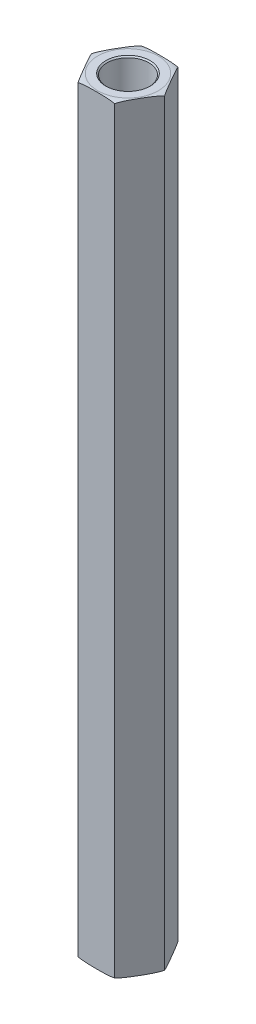
ISO-10303-21;
HEADER;
FILE_DESCRIPTION(('STEP AP214'),'2;1');
FILE_NAME('part.step','',(''),(''),'','','');
FILE_SCHEMA(('AUTOMOTIVE_DESIGN { 1 0 10303 214 1 1 1 1 }'));
ENDSEC;
DATA;
#1=APPLICATION_CONTEXT('core data for automotive mechanical design processes');
#2=APPLICATION_PROTOCOL_DEFINITION('international standard','automotive_design',2000,#1);
#3=PRODUCT_CONTEXT('',#1,'mechanical');
#4=PRODUCT('Part','Part','',(#3));
#5=PRODUCT_RELATED_PRODUCT_CATEGORY('part','',(#4));
#6=PRODUCT_DEFINITION_FORMATION('','',#4);
#7=PRODUCT_DEFINITION_CONTEXT('part definition',#1,'design');
#8=PRODUCT_DEFINITION('design','',#6,#7);
#9=PRODUCT_DEFINITION_SHAPE('','',#8);
#10=(LENGTH_UNIT() NAMED_UNIT(*) SI_UNIT(.MILLI.,.METRE.));
#11=(NAMED_UNIT(*) PLANE_ANGLE_UNIT() SI_UNIT($,.RADIAN.));
#12=(NAMED_UNIT(*) SI_UNIT($,.STERADIAN.) SOLID_ANGLE_UNIT());
#13=UNCERTAINTY_MEASURE_WITH_UNIT(LENGTH_MEASURE(1.E-05),#10,'distance_accuracy_value','');
#14=(GEOMETRIC_REPRESENTATION_CONTEXT(3) GLOBAL_UNCERTAINTY_ASSIGNED_CONTEXT((#13)) GLOBAL_UNIT_ASSIGNED_CONTEXT((#10,
#11,#12)) REPRESENTATION_CONTEXT('',''));
#15=CARTESIAN_POINT('',(0.,0.,0.));
#16=DIRECTION('',(0.,0.,1.));
#17=DIRECTION('',(1.,0.,0.));
#18=AXIS2_PLACEMENT_3D('',#15,#16,#17);
#19=CARTESIAN_POINT('',(0.,25.4,0.));
#20=DIRECTION('',(0.,1.,0.));
#21=DIRECTION('',(0.,0.,1.));
#22=AXIS2_PLACEMENT_3D('',#19,#20,#21);
#23=PLANE('',#22);
#24=CARTESIAN_POINT('',(0.,25.4,0.));
#25=DIRECTION('',(0.,1.,0.));
#26=DIRECTION('',(0.,0.,1.));
#27=AXIS2_PLACEMENT_3D('',#24,#25,#26);
#28=CIRCLE('',#27,2.0955);
#29=CARTESIAN_POINT('',(0.,25.4,2.0955));
#30=VERTEX_POINT('',#29);
#31=EDGE_CURVE('E363',#30,#30,#28,.T.);
#32=ORIENTED_EDGE('',*,*,#31,.T.);
#33=EDGE_LOOP('',(#32));
#34=FACE_BOUND('',#33,.T.);
#35=ADVANCED_FACE('F14',(#34),#23,.T.);
#36=CARTESIAN_POINT('',(0.,-25.4,0.));
#37=DIRECTION('',(0.,-1.,0.));
#38=DIRECTION('',(0.,0.,-1.));
#39=AXIS2_PLACEMENT_3D('',#36,#37,#38);
#40=PLANE('',#39);
#41=CARTESIAN_POINT('',(0.,-25.4,0.));
#42=DIRECTION('',(0.,-1.,0.));
#43=DIRECTION('',(0.,0.,-1.));
#44=AXIS2_PLACEMENT_3D('',#41,#42,#43);
#45=CIRCLE('',#44,2.0955);
#46=CARTESIAN_POINT('',(0.,-25.4,-2.0955));
#47=VERTEX_POINT('',#46);
#48=EDGE_CURVE('E365',#47,#47,#45,.T.);
#49=ORIENTED_EDGE('',*,*,#48,.T.);
#50=EDGE_LOOP('',(#49));
#51=FACE_BOUND('',#50,.T.);
#52=ADVANCED_FACE('F342',(#51),#40,.T.);
#53=CARTESIAN_POINT('',(0.,25.4,0.));
#54=DIRECTION('',(0.,1.,0.));
#55=DIRECTION('',(0.,0.,1.));
#56=AXIS2_PLACEMENT_3D('',#53,#54,#55);
#57=CYLINDRICAL_SURFACE('',#56,2.0955);
#58=CARTESIAN_POINT('',(0.,37.9730000000222,0.));
#59=DIRECTION('',(0.,1.,0.));
#60=DIRECTION('',(0.,0.,1.));
#61=AXIS2_PLACEMENT_3D('',#58,#59,#60);
#62=CIRCLE('',#61,2.09549999999581);
#63=CARTESIAN_POINT('',(0.,37.9730000000222,2.09549999999581));
#64=VERTEX_POINT('',#63);
#65=EDGE_CURVE('E368',#64,#64,#62,.T.);
#66=ORIENTED_EDGE('',*,*,#65,.T.);
#67=EDGE_LOOP('',(#66));
#68=FACE_BOUND('',#67,.T.);
#69=ORIENTED_EDGE('',*,*,#31,.F.);
#70=EDGE_LOOP('',(#69));
#71=FACE_BOUND('',#70,.T.);
#72=ADVANCED_FACE('F334',(#68,#71),#57,.F.);
#73=CARTESIAN_POINT('',(0.,-25.4,0.));
#74=DIRECTION('',(0.,-1.,0.));
#75=DIRECTION('',(0.,0.,-1.));
#76=AXIS2_PLACEMENT_3D('',#73,#74,#75);
#77=CYLINDRICAL_SURFACE('',#76,2.0955);
#78=ORIENTED_EDGE('',*,*,#48,.F.);
#79=EDGE_LOOP('',(#78));
#80=FACE_BOUND('',#79,.T.);
#81=CARTESIAN_POINT('',(0.,-37.9729999999654,0.));
#82=DIRECTION('',(0.,-1.,0.));
#83=DIRECTION('',(0.,0.,-1.));
#84=AXIS2_PLACEMENT_3D('',#81,#82,#83);
#85=CIRCLE('',#84,2.09549999999581);
#86=CARTESIAN_POINT('',(0.,-37.9729999999654,-2.09549999999581));
#87=VERTEX_POINT('',#86);
#88=EDGE_CURVE('E398',#87,#87,#85,.T.);
#89=ORIENTED_EDGE('',*,*,#88,.T.);
#90=EDGE_LOOP('',(#89));
#91=FACE_BOUND('',#90,.T.);
#92=ADVANCED_FACE('F326',(#80,#91),#77,.F.);
#93=CARTESIAN_POINT('',(0.,38.099999999929,0.));
#94=DIRECTION('',(0.,1.,0.));
#95=DIRECTION('',(0.,0.,1.));
#96=AXIS2_PLACEMENT_3D('',#93,#94,#95);
#97=CONICAL_SURFACE('',#96,2.22249999990254,0.785398163397448);
#98=CARTESIAN_POINT('',(0.,38.1000000000427,0.));
#99=DIRECTION('',(0.,1.,0.));
#100=DIRECTION('',(0.,0.,1.));
#101=AXIS2_PLACEMENT_3D('',#98,#99,#100);
#102=CIRCLE('',#101,2.22250000001623);
#103=CARTESIAN_POINT('',(0.,38.1000000000427,2.22250000001623));
#104=VERTEX_POINT('',#103);
#105=EDGE_CURVE('E78',#104,#104,#102,.T.);
#106=ORIENTED_EDGE('',*,*,#105,.T.);
#107=EDGE_LOOP('',(#106));
#108=FACE_BOUND('',#107,.T.);
#109=ORIENTED_EDGE('',*,*,#65,.F.);
#110=EDGE_LOOP('',(#109));
#111=FACE_BOUND('',#110,.T.);
#112=ADVANCED_FACE('F320',(#108,#111),#97,.F.);
#113=CARTESIAN_POINT('',(-3.66617420935413,38.1,0.));
#114=DIRECTION('',(0.866025403784439,0.,-0.499999999999999));
#115=DIRECTION('',(-0.499999999999999,0.,-0.866025403784439));
#116=AXIS2_PLACEMENT_3D('',#113,#114,#115);
#117=PLANE('',#116);
#118=DIRECTION('',(0.,1.,0.));
#119=VECTOR('',#118,1.);
#120=CARTESIAN_POINT('',(-1.83308710467708,38.1,3.175));
#121=LINE('',#120,#119);
#122=CARTESIAN_POINT('',(-1.83308710467708,-37.973,3.17499999999999));
#123=VERTEX_POINT('',#122);
#124=CARTESIAN_POINT('',(-1.83308710467706,37.973,3.175));
#125=VERTEX_POINT('',#124);
#126=EDGE_CURVE('E74',#123,#125,#121,.T.);
#127=ORIENTED_EDGE('',*,*,#126,.T.);
#128=CARTESIAN_POINT('',(-3.66617420935412,37.973,0.));
#129=CARTESIAN_POINT('',(-3.62797961467394,37.9889014148997,0.0661549785605819));
#130=CARTESIAN_POINT('',(-3.58956810864155,38.0024886076105,0.132685658603916));
#131=CARTESIAN_POINT('',(-3.51249051795707,38.0258161979402,0.266187961794432));
#132=CARTESIAN_POINT('',(-3.47382473049842,38.0355604771397,0.33315907018748));
#133=CARTESIAN_POINT('',(-3.39641631867867,38.0519966530451,0.467234372392504));
#134=CARTESIAN_POINT('',(-3.35767399633305,38.0586945328669,0.534338043098325));
#135=CARTESIAN_POINT('',(-3.28009834620104,38.0697767572932,0.668703010557156));
#136=CARTESIAN_POINT('',(-3.24126499587761,38.074160450474,0.73596434634546));
#137=CARTESIAN_POINT('',(-3.16354065964302,38.0812403004263,0.870586845688324));
#138=CARTESIAN_POINT('',(-3.12464965374463,38.0839355237591,0.937948043861812));
#139=CARTESIAN_POINT('',(-3.04685144594578,38.0881531983713,1.07269849250722));
#140=CARTESIAN_POINT('',(-3.00794424351953,38.0896756080272,1.14008774388985));
#141=CARTESIAN_POINT('',(-2.93051517598855,38.091922705889,1.27419882283619));
#142=CARTESIAN_POINT('',(-2.89199336248915,38.0926552468181,1.34092056101683));
#143=CARTESIAN_POINT('',(-2.81494778346123,38.0935767302574,1.47436741839177));
#144=CARTESIAN_POINT('',(-2.77642401791417,38.0937656658949,1.54109253761814));
#145=CARTESIAN_POINT('',(-2.69935964430989,38.0936659966806,1.67457194815423));
#146=CARTESIAN_POINT('',(-2.66081903631797,38.0933771811765,1.74132623935083));
#147=CARTESIAN_POINT('',(-2.58373908085303,38.092221986219,1.87483263846125));
#148=CARTESIAN_POINT('',(-2.54519973341218,38.0913555970386,1.94158474631936));
#149=CARTESIAN_POINT('',(-2.46812969629741,38.0887861940656,2.07507396634335));
#150=CARTESIAN_POINT('',(-2.42959900625935,38.0870832271616,2.14181107913996));
#151=CARTESIAN_POINT('',(-2.35255651340876,38.0824387229726,2.27525259109894));
#152=CARTESIAN_POINT('',(-2.3140447097541,38.0794972471358,2.34195699171994));
#153=CARTESIAN_POINT('',(-2.25084206239913,38.0732174124748,2.45142718811161));
#154=CARTESIAN_POINT('',(-2.2261384933698,38.0703980110463,2.49421502479869));
#155=CARTESIAN_POINT('',(-2.17676945272201,38.0638696794303,2.57972471152158));
#156=CARTESIAN_POINT('',(-2.15210397034159,38.0601610809139,2.62244658019767));
#157=CARTESIAN_POINT('',(-2.10282753811675,38.0516802711496,2.70779586442681));
#158=CARTESIAN_POINT('',(-2.0782165710751,38.0469084657008,2.75042330976635));
#159=CARTESIAN_POINT('',(-2.02900094683535,38.0360987712516,2.83566727147583));
#160=CARTESIAN_POINT('',(-2.00439646085451,38.0300577313084,2.87828349128876));
#161=CARTESIAN_POINT('',(-1.95527325900924,38.0165138354161,2.96336737271522));
#162=CARTESIAN_POINT('',(-1.93075459617607,38.0090101978029,3.00583494247592));
#163=CARTESIAN_POINT('',(-1.88182157373168,37.9923203507084,3.09058942351752));
#164=CARTESIAN_POINT('',(-1.85740744053269,37.9831314978033,3.13287594264093));
#165=CARTESIAN_POINT('',(-1.83308710467707,37.973,3.175));
#166=B_SPLINE_CURVE_WITH_KNOTS('',3,(#128,#129,#130,#131,#132,#133,#134,#135,#136,#137,#138,
#139,#140,#141,#142,#143,#144,#145,#146,#147,#148,#149,#150,#151,#152,#153,#154,#155,#156,#157,
#158,#159,#160,#161,#162,#163,#164,#165),.UNSPECIFIED.,.F.,.F.,(4,2,2,2,2,2,2,2,2,2,2,2,2,2,2,2,
2,2,4),(0.,0.233977307817999,0.467717675040806,0.70099697355767,0.934341903229977,
1.16781571967268,1.40129782179859,1.63243665809709,1.86357841666662,2.09482211846345,
2.32606971471551,2.5573043514746,2.78852751694481,2.93698369265143,3.08538458004518,
3.23372892334618,3.38244598546635,3.53124274626094,3.68027493713584),.UNSPECIFIED.);
#167=CARTESIAN_POINT('',(-3.66617420935412,37.973,0.));
#168=VERTEX_POINT('',#167);
#169=EDGE_CURVE('E67',#168,#125,#166,.T.);
#170=ORIENTED_EDGE('',*,*,#169,.F.);
#171=DIRECTION('',(0.,1.,0.));
#172=VECTOR('',#171,1.);
#173=CARTESIAN_POINT('',(-3.66617420935413,38.1,0.));
#174=LINE('',#173,#172);
#175=CARTESIAN_POINT('',(-3.66617420935413,-37.973,0.));
#176=VERTEX_POINT('',#175);
#177=EDGE_CURVE('E71',#168,#176,#174,.F.);
#178=ORIENTED_EDGE('',*,*,#177,.T.);
#179=CARTESIAN_POINT('',(-1.83308710467708,-37.973,3.17499999999999));
#180=CARTESIAN_POINT('',(-1.87128169935726,-37.9889014148997,3.10884502143941));
#181=CARTESIAN_POINT('',(-1.90969320538965,-38.0024886076105,3.04231434139608));
#182=CARTESIAN_POINT('',(-1.98677079607412,-38.0258161979402,2.90881203820556));
#183=CARTESIAN_POINT('',(-2.02543658353278,-38.0355604771397,2.84184092981251));
#184=CARTESIAN_POINT('',(-2.10284499535253,-38.0519966530451,2.70776562760749));
#185=CARTESIAN_POINT('',(-2.14158731769815,-38.0586945328669,2.64066195690167));
#186=CARTESIAN_POINT('',(-2.21916296783016,-38.0697767572932,2.50629698944284));
#187=CARTESIAN_POINT('',(-2.25799631815359,-38.074160450474,2.43903565365453));
#188=CARTESIAN_POINT('',(-2.33572065438817,-38.0812403004263,2.30441315431167));
#189=CARTESIAN_POINT('',(-2.37461166028657,-38.0839355237591,2.23705195613818));
#190=CARTESIAN_POINT('',(-2.45240986808542,-38.0881531983713,2.10230150749277));
#191=CARTESIAN_POINT('',(-2.49131707051166,-38.0896756080272,2.03491225611015));
#192=CARTESIAN_POINT('',(-2.56874613804265,-38.091922705889,1.90080117716381));
#193=CARTESIAN_POINT('',(-2.60726795154204,-38.0926552468181,1.83407943898316));
#194=CARTESIAN_POINT('',(-2.68431353056997,-38.0935767302574,1.70063258160822));
#195=CARTESIAN_POINT('',(-2.72283729611702,-38.0937656658949,1.63390746238186));
#196=CARTESIAN_POINT('',(-2.79990166972131,-38.0936659966806,1.50042805184576));
#197=CARTESIAN_POINT('',(-2.83844227771323,-38.0933771811765,1.43367376064916));
#198=CARTESIAN_POINT('',(-2.91552223317816,-38.092221986219,1.30016736153875));
#199=CARTESIAN_POINT('',(-2.95406158061902,-38.0913555970386,1.23341525368064));
#200=CARTESIAN_POINT('',(-3.03113161773378,-38.0887861940656,1.09992603365665));
#201=CARTESIAN_POINT('',(-3.06966230777185,-38.0870832271616,1.03318892086003));
#202=CARTESIAN_POINT('',(-3.14670480062243,-38.0824387229726,0.899747408901055));
#203=CARTESIAN_POINT('',(-3.1852166042771,-38.0794972471358,0.833043008280054));
#204=CARTESIAN_POINT('',(-3.24841925163207,-38.0732174124748,0.723572811888387));
#205=CARTESIAN_POINT('',(-3.2731228206614,-38.0703980110463,0.680784975201305));
#206=CARTESIAN_POINT('',(-3.32249186130918,-38.0638696794303,0.595275288478412));
#207=CARTESIAN_POINT('',(-3.3471573436896,-38.0601610809139,0.552553419802322));
#208=CARTESIAN_POINT('',(-3.39643377591444,-38.0516802711496,0.467204135573181));
#209=CARTESIAN_POINT('',(-3.42104474295609,-38.0469084657008,0.424576690233639));
#210=CARTESIAN_POINT('',(-3.47026036719585,-38.0360987712516,0.339332728524166));
#211=CARTESIAN_POINT('',(-3.49486485317669,-38.0300577313084,0.296716508711228));
#212=CARTESIAN_POINT('',(-3.54398805502195,-38.0165138354161,0.211632627284775));
#213=CARTESIAN_POINT('',(-3.56850671785512,-38.0090101978029,0.169165057524068));
#214=CARTESIAN_POINT('',(-3.61743974029951,-37.9923203507084,0.0844105764824759));
#215=CARTESIAN_POINT('',(-3.64185387349851,-37.9831314978033,0.0421240573590602));
#216=CARTESIAN_POINT('',(-3.66617420935413,-37.973,0.));
#217=B_SPLINE_CURVE_WITH_KNOTS('',3,(#179,#180,#181,#182,#183,#184,#185,#186,#187,#188,#189,
#190,#191,#192,#193,#194,#195,#196,#197,#198,#199,#200,#201,#202,#203,#204,#205,#206,#207,#208,
#209,#210,#211,#212,#213,#214,#215,#216),.UNSPECIFIED.,.F.,.F.,(4,2,2,2,2,2,2,2,2,2,2,2,2,2,2,2,
2,2,4),(0.,0.233977307817999,0.467717675040806,0.700996973557671,0.934341903229978,
1.16781571967268,1.40129782179859,1.63243665809709,1.86357841666662,2.09482211846345,
2.32606971471551,2.5573043514746,2.78852751694481,2.93698369265144,3.08538458004519,
3.23372892334618,3.38244598546635,3.53124274626095,3.68027493713584),.UNSPECIFIED.);
#218=EDGE_CURVE('E86',#123,#176,#217,.T.);
#219=ORIENTED_EDGE('',*,*,#218,.F.);
#220=EDGE_LOOP('',(#127,#170,#178,#219));
#221=FACE_BOUND('',#220,.T.);
#222=ADVANCED_FACE('F69',(#221),#117,.F.);
#223=CARTESIAN_POINT('',(0.,-38.0999999998153,0.));
#224=DIRECTION('',(0.,-1.,0.));
#225=DIRECTION('',(0.,0.,-1.));
#226=AXIS2_PLACEMENT_3D('',#223,#224,#225);
#227=CONICAL_SURFACE('',#226,2.2224999998457,0.785398163397448);
#228=ORIENTED_EDGE('',*,*,#88,.F.);
#229=EDGE_LOOP('',(#228));
#230=FACE_BOUND('',#229,.T.);
#231=CARTESIAN_POINT('',(0.,-38.099999999929,0.));
#232=DIRECTION('',(0.,-1.,0.));
#233=DIRECTION('',(0.,0.,-1.));
#234=AXIS2_PLACEMENT_3D('',#231,#232,#233);
#235=CIRCLE('',#234,2.22249999995938);
#236=CARTESIAN_POINT('',(0.,-38.099999999929,-2.22249999995938));
#237=VERTEX_POINT('',#236);
#238=EDGE_CURVE('E139',#237,#237,#235,.F.);
#239=ORIENTED_EDGE('',*,*,#238,.F.);
#240=EDGE_LOOP('',(#239));
#241=FACE_BOUND('',#240,.T.);
#242=ADVANCED_FACE('F307',(#230,#241),#227,.F.);
#243=CARTESIAN_POINT('',(-1.83308710467707,38.1,-3.175));
#244=DIRECTION('',(0.,-1.,0.));
#245=DIRECTION('',(0.,0.,-1.));
#246=AXIS2_PLACEMENT_3D('',#243,#244,#245);
#247=PLANE('',#246);
#248=CARTESIAN_POINT('',(0.,38.1,0.));
#249=DIRECTION('',(0.,-1.,0.));
#250=DIRECTION('',(0.,0.,1.));
#251=AXIS2_PLACEMENT_3D('',#248,#249,#250);
#252=CIRCLE('',#251,3.03117420935412);
#253=CARTESIAN_POINT('',(0.,38.1,3.03117420935411));
#254=VERTEX_POINT('',#253);
#255=CARTESIAN_POINT('',(0.,38.1,-3.03117420935411));
#256=VERTEX_POINT('',#255);
#257=EDGE_CURVE('E77',#254,#256,#252,.T.);
#258=ORIENTED_EDGE('',*,*,#257,.F.);
#259=CARTESIAN_POINT('',(0.,38.1,0.));
#260=DIRECTION('',(0.,-1.,0.));
#261=DIRECTION('',(0.,0.,-1.));
#262=AXIS2_PLACEMENT_3D('',#259,#260,#261);
#263=CIRCLE('',#262,3.03117420935412);
#264=EDGE_CURVE('E150',#256,#254,#263,.T.);
#265=ORIENTED_EDGE('',*,*,#264,.F.);
#266=EDGE_LOOP('',(#258,#265));
#267=FACE_BOUND('',#266,.T.);
#268=ORIENTED_EDGE('',*,*,#105,.F.);
#269=EDGE_LOOP('',(#268));
#270=FACE_BOUND('',#269,.T.);
#271=ADVANCED_FACE('F114',(#267,#270),#247,.F.);
#272=CARTESIAN_POINT('',(-1.83308710467707,38.1,-3.175));
#273=DIRECTION('',(0.866025403784439,0.,0.5));
#274=DIRECTION('',(0.5,0.,-0.866025403784439));
#275=AXIS2_PLACEMENT_3D('',#272,#273,#274);
#276=PLANE('',#275);
#277=ORIENTED_EDGE('',*,*,#177,.F.);
#278=CARTESIAN_POINT('',(-1.83308710467706,37.973,-3.17500000000001));
#279=CARTESIAN_POINT('',(-1.87128169935724,37.9889014148997,-3.10884502143944));
#280=CARTESIAN_POINT('',(-1.90969320538963,38.0024886076105,-3.0423143413961));
#281=CARTESIAN_POINT('',(-1.98677079607411,38.0258161979402,-2.90881203820559));
#282=CARTESIAN_POINT('',(-2.02543658353276,38.0355604771397,-2.84184092981255));
#283=CARTESIAN_POINT('',(-2.10284499535251,38.0519966530451,-2.70776562760753));
#284=CARTESIAN_POINT('',(-2.14158731769812,38.0586945328669,-2.64066195690171));
#285=CARTESIAN_POINT('',(-2.21916296783013,38.0697767572932,-2.50629698944288));
#286=CARTESIAN_POINT('',(-2.25799631815356,38.074160450474,-2.43903565365458));
#287=CARTESIAN_POINT('',(-2.33572065438814,38.0812403004263,-2.30441315431172));
#288=CARTESIAN_POINT('',(-2.37461166028654,38.0839355237591,-2.23705195613824));
#289=CARTESIAN_POINT('',(-2.45240986808539,38.0881531983713,-2.10230150749283));
#290=CARTESIAN_POINT('',(-2.49131707051163,38.0896756080272,-2.03491225611021));
#291=CARTESIAN_POINT('',(-2.56874613804261,38.091922705889,-1.90080117716387));
#292=CARTESIAN_POINT('',(-2.60726795154201,38.0926552468181,-1.83407943898323));
#293=CARTESIAN_POINT('',(-2.68431353056993,38.0935767302574,-1.7006325816083));
#294=CARTESIAN_POINT('',(-2.72283729611698,38.0937656658949,-1.63390746238193));
#295=CARTESIAN_POINT('',(-2.79990166972127,38.0936659966806,-1.50042805184584));
#296=CARTESIAN_POINT('',(-2.83844227771319,38.0933771811765,-1.43367376064924));
#297=CARTESIAN_POINT('',(-2.91552223317812,38.092221986219,-1.30016736153883));
#298=CARTESIAN_POINT('',(-2.95406158061897,38.0913555970386,-1.23341525368073));
#299=CARTESIAN_POINT('',(-3.03113161773373,38.0887861940656,-1.09992603365674));
#300=CARTESIAN_POINT('',(-3.0696623077718,38.0870832271616,-1.03318892086012));
#301=CARTESIAN_POINT('',(-3.14670480062238,38.0824387229726,-0.899747408901154));
#302=CARTESIAN_POINT('',(-3.18521660427705,38.0794972471358,-0.833043008280155));
#303=CARTESIAN_POINT('',(-3.24841925163202,38.0732174124748,-0.723572811888486));
#304=CARTESIAN_POINT('',(-3.27312282066135,38.0703980110463,-0.680784975201399));
#305=CARTESIAN_POINT('',(-3.32249186130914,38.0638696794303,-0.595275288478496));
#306=CARTESIAN_POINT('',(-3.34715734368956,38.0601610809139,-0.5525534198024));
#307=CARTESIAN_POINT('',(-3.39643377591441,38.0516802711496,-0.467204135573248));
#308=CARTESIAN_POINT('',(-3.42104474295606,38.0469084657008,-0.424576690233701));
#309=CARTESIAN_POINT('',(-3.47026036719582,38.0360987712516,-0.339332728524218));
#310=CARTESIAN_POINT('',(-3.49486485317667,38.0300577313084,-0.296716508711275));
#311=CARTESIAN_POINT('',(-3.54398805502193,38.0165138354161,-0.211632627284812));
#312=CARTESIAN_POINT('',(-3.56850671785511,38.0090101978029,-0.1691650575241));
#313=CARTESIAN_POINT('',(-3.61743974029951,37.9923203507084,-0.0844105764824972));
#314=CARTESIAN_POINT('',(-3.64185387349851,37.9831314978033,-0.0421240573590767));
#315=CARTESIAN_POINT('',(-3.66617420935413,37.973,0.));
#316=B_SPLINE_CURVE_WITH_KNOTS('',3,(#278,#279,#280,#281,#282,#283,#284,#285,#286,#287,#288,
#289,#290,#291,#292,#293,#294,#295,#296,#297,#298,#299,#300,#301,#302,#303,#304,#305,#306,#307,
#308,#309,#310,#311,#312,#313,#314,#315),.UNSPECIFIED.,.F.,.F.,(4,2,2,2,2,2,2,2,2,2,2,2,2,2,2,2,
2,2,4),(0.,0.233977307817992,0.467717675040792,0.700996973557648,0.934341903229947,
1.16781571967264,1.40129782179854,1.63243665809704,1.86357841666656,2.09482211846338,
2.32606971471544,2.55730435147452,2.78852751694472,2.93698369265136,3.08538458004513,
3.23372892334615,3.38244598546633,3.53124274626095,3.68027493713586),.UNSPECIFIED.);
#317=CARTESIAN_POINT('',(-1.83308710467705,37.973,-3.17500000000001));
#318=VERTEX_POINT('',#317);
#319=EDGE_CURVE('E83',#318,#168,#316,.T.);
#320=ORIENTED_EDGE('',*,*,#319,.F.);
#321=DIRECTION('',(0.,1.,0.));
#322=VECTOR('',#321,1.);
#323=CARTESIAN_POINT('',(-1.83308710467705,38.1,-3.175));
#324=LINE('',#323,#322);
#325=CARTESIAN_POINT('',(-1.83308710467707,-37.973,-3.175));
#326=VERTEX_POINT('',#325);
#327=EDGE_CURVE('E172',#318,#326,#324,.F.);
#328=ORIENTED_EDGE('',*,*,#327,.T.);
#329=CARTESIAN_POINT('',(-3.66617420935413,-37.973,0.));
#330=CARTESIAN_POINT('',(-3.62797961467395,-37.9889014148997,-0.0661549785605743));
#331=CARTESIAN_POINT('',(-3.58956810864156,-38.0024886076105,-0.132685658603907));
#332=CARTESIAN_POINT('',(-3.51249051795708,-38.0258161979402,-0.266187961794421));
#333=CARTESIAN_POINT('',(-3.47382473049843,-38.0355604771397,-0.333159070187467));
#334=CARTESIAN_POINT('',(-3.39641631867868,-38.0519966530451,-0.467234372392488));
#335=CARTESIAN_POINT('',(-3.35767399633306,-38.0586945328669,-0.534338043098307));
#336=CARTESIAN_POINT('',(-3.28009834620105,-38.0697767572932,-0.668703010557135));
#337=CARTESIAN_POINT('',(-3.24126499587762,-38.074160450474,-0.735964346345438));
#338=CARTESIAN_POINT('',(-3.16354065964304,-38.0812403004263,-0.870586845688298));
#339=CARTESIAN_POINT('',(-3.12464965374464,-38.0839355237591,-0.937948043861785));
#340=CARTESIAN_POINT('',(-3.0468514459458,-38.0881531983713,-1.07269849250719));
#341=CARTESIAN_POINT('',(-3.00794424351955,-38.0896756080272,-1.14008774388981));
#342=CARTESIAN_POINT('',(-2.93051517598857,-38.091922705889,-1.27419882283615));
#343=CARTESIAN_POINT('',(-2.89199336248918,-38.0926552468181,-1.3409205610168));
#344=CARTESIAN_POINT('',(-2.81494778346125,-38.0935767302574,-1.47436741839173));
#345=CARTESIAN_POINT('',(-2.7764240179142,-38.0937656658949,-1.5410925376181));
#346=CARTESIAN_POINT('',(-2.69935964430991,-38.0936659966806,-1.67457194815419));
#347=CARTESIAN_POINT('',(-2.66081903631799,-38.0933771811765,-1.74132623935079));
#348=CARTESIAN_POINT('',(-2.58373908085306,-38.092221986219,-1.8748326384612));
#349=CARTESIAN_POINT('',(-2.54519973341221,-38.0913555970386,-1.94158474631931));
#350=CARTESIAN_POINT('',(-2.46812969629744,-38.0887861940656,-2.0750739663433));
#351=CARTESIAN_POINT('',(-2.42959900625938,-38.0870832271616,-2.14181107913991));
#352=CARTESIAN_POINT('',(-2.35255651340879,-38.0824387229726,-2.27525259109889));
#353=CARTESIAN_POINT('',(-2.31404470975413,-38.0794972471358,-2.34195699171989));
#354=CARTESIAN_POINT('',(-2.25084206239916,-38.0732174124748,-2.45142718811155));
#355=CARTESIAN_POINT('',(-2.22613849336983,-38.0703980110463,-2.49421502479864));
#356=CARTESIAN_POINT('',(-2.17676945272204,-38.0638696794303,-2.57972471152153));
#357=CARTESIAN_POINT('',(-2.15210397034162,-38.0601610809139,-2.62244658019763));
#358=CARTESIAN_POINT('',(-2.10282753811678,-38.0516802711496,-2.70779586442677));
#359=CARTESIAN_POINT('',(-2.07821657107513,-38.0469084657008,-2.75042330976632));
#360=CARTESIAN_POINT('',(-2.02900094683537,-38.0360987712516,-2.8356672714758));
#361=CARTESIAN_POINT('',(-2.00439646085452,-38.0300577313084,-2.87828349128874));
#362=CARTESIAN_POINT('',(-1.95527325900926,-38.0165138354161,-2.96336737271519));
#363=CARTESIAN_POINT('',(-1.93075459617608,-38.0090101978029,-3.0058349424759));
#364=CARTESIAN_POINT('',(-1.88182157373169,-37.9923203507084,-3.0905894235175));
#365=CARTESIAN_POINT('',(-1.85740744053269,-37.9831314978033,-3.13287594264092));
#366=CARTESIAN_POINT('',(-1.83308710467707,-37.973,-3.17499999999999));
#367=B_SPLINE_CURVE_WITH_KNOTS('',3,(#329,#330,#331,#332,#333,#334,#335,#336,#337,#338,#339,
#340,#341,#342,#343,#344,#345,#346,#347,#348,#349,#350,#351,#352,#353,#354,#355,#356,#357,#358,
#359,#360,#361,#362,#363,#364,#365,#366),.UNSPECIFIED.,.F.,.F.,(4,2,2,2,2,2,2,2,2,2,2,2,2,2,2,2,
2,2,4),(0.,0.233977307817996,0.467717675040799,0.700996973557657,0.934341903229959,
1.16781571967266,1.40129782179856,1.63243665809706,1.86357841666659,2.09482211846341,
2.32606971471547,2.55730435147455,2.78852751694475,2.93698369265139,3.08538458004515,
3.23372892334615,3.38244598546633,3.53124274626093,3.68027493713584),.UNSPECIFIED.);
#368=EDGE_CURVE('E85',#176,#326,#367,.T.);
#369=ORIENTED_EDGE('',*,*,#368,.F.);
#370=EDGE_LOOP('',(#277,#320,#328,#369));
#371=FACE_BOUND('',#370,.T.);
#372=ADVANCED_FACE('F81',(#371),#276,.F.);
#373=CARTESIAN_POINT('',(-1.83308710467707,38.1,3.175));
#374=DIRECTION('',(0.,0.,-1.));
#375=DIRECTION('',(-1.,0.,0.));
#376=AXIS2_PLACEMENT_3D('',#373,#374,#375);
#377=PLANE('',#376);
#378=DIRECTION('',(0.,1.,0.));
#379=VECTOR('',#378,1.);
#380=CARTESIAN_POINT('',(1.83308710467706,38.1,3.17499999999999));
#381=LINE('',#380,#379);
#382=CARTESIAN_POINT('',(1.83308710467706,-37.973,3.17499999999999));
#383=VERTEX_POINT('',#382);
#384=CARTESIAN_POINT('',(1.83308710467706,37.973,3.17499999999999));
#385=VERTEX_POINT('',#384);
#386=EDGE_CURVE('E170',#383,#385,#381,.T.);
#387=ORIENTED_EDGE('',*,*,#386,.T.);
#388=CARTESIAN_POINT('',(-1.83308710467706,37.973,3.175));
#389=CARTESIAN_POINT('',(-1.73237579828683,37.9939400141518,3.175));
#390=CARTESIAN_POINT('',(-1.63096506893486,38.0108853495327,3.175));
#391=CARTESIAN_POINT('',(-1.42767146651469,38.0384971643984,3.175));
#392=CARTESIAN_POINT('',(-1.32579191427254,38.0491875658753,3.175));
#393=CARTESIAN_POINT('',(-1.12177634709137,38.0661280408079,3.175));
#394=CARTESIAN_POINT('',(-1.0196405664338,38.0723812707189,3.175));
#395=CARTESIAN_POINT('',(-0.815663681397376,38.0819028064183,3.175));
#396=CARTESIAN_POINT('',(-0.713823115514573,38.0851834044999,3.175));
#397=CARTESIAN_POINT('',(-0.510018485441651,38.0899454848703,3.175));
#398=CARTESIAN_POINT('',(-0.408054390577977,38.0914254100882,3.175));
#399=CARTESIAN_POINT('',(-0.20406020033787,38.0933146818379,3.175));
#400=CARTESIAN_POINT('',(-0.102030100168935,38.0937234241492,3.175));
#401=CARTESIAN_POINT('',(0.102030100168936,38.0937234241492,3.175));
#402=CARTESIAN_POINT('',(0.204060200337871,38.0933146818379,3.17499999999999));
#403=CARTESIAN_POINT('',(0.408054390577978,38.0914254100882,3.17499999999999));
#404=CARTESIAN_POINT('',(0.510018485441653,38.0899454848703,3.17499999999999));
#405=CARTESIAN_POINT('',(0.713823115514575,38.0851834044999,3.17499999999999));
#406=CARTESIAN_POINT('',(0.815663681397378,38.0819028064183,3.17499999999999));
#407=CARTESIAN_POINT('',(1.0196405664338,38.0723812707189,3.17499999999999));
#408=CARTESIAN_POINT('',(1.12177634709138,38.0661280408079,3.17499999999999));
#409=CARTESIAN_POINT('',(1.32579191427254,38.0491875658753,3.17499999999999));
#410=CARTESIAN_POINT('',(1.42767146651469,38.0384971643984,3.17499999999999));
#411=CARTESIAN_POINT('',(1.63096506893486,38.0108853495327,3.17499999999999));
#412=CARTESIAN_POINT('',(1.73237579828684,37.9939400141518,3.17499999999999));
#413=CARTESIAN_POINT('',(1.83308710467706,37.973,3.17499999999999));
#414=B_SPLINE_CURVE_WITH_KNOTS('',3,(#388,#389,#390,#391,#392,#393,#394,#395,#396,#397,#398,
#399,#400,#401,#402,#403,#404,#405,#406,#407,#408,#409,#410,#411,#412,#413),.UNSPECIFIED.,.F.,
.F.,(4,2,2,2,2,2,2,2,2,2,2,2,4),(0.,0.308333242342807,0.615479423308235,0.922406891130009,
1.2280592962085,1.53397581645216,1.84006485747889,2.14615389850562,2.45207041874928,
2.75772282382777,3.06465029164954,3.37179647261497,3.68012971495778),.UNSPECIFIED.);
#415=EDGE_CURVE('E143',#125,#385,#414,.T.);
#416=ORIENTED_EDGE('',*,*,#415,.F.);
#417=ORIENTED_EDGE('',*,*,#126,.F.);
#418=CARTESIAN_POINT('',(1.83308710467706,-37.973,3.17499999999999));
#419=CARTESIAN_POINT('',(1.73237579828683,-37.9939400141518,3.17499999999999));
#420=CARTESIAN_POINT('',(1.63096506893486,-38.0108853495327,3.17499999999999));
#421=CARTESIAN_POINT('',(1.42767146651469,-38.0384971643984,3.17499999999999));
#422=CARTESIAN_POINT('',(1.32579191427254,-38.0491875658753,3.17499999999999));
#423=CARTESIAN_POINT('',(1.12177634709138,-38.0661280408079,3.17499999999999));
#424=CARTESIAN_POINT('',(1.0196405664338,-38.0723812707189,3.17499999999999));
#425=CARTESIAN_POINT('',(0.815663681397377,-38.0819028064183,3.17499999999999));
#426=CARTESIAN_POINT('',(0.713823115514574,-38.0851834044999,3.17499999999999));
#427=CARTESIAN_POINT('',(0.510018485441652,-38.0899454848703,3.17499999999999));
#428=CARTESIAN_POINT('',(0.408054390577977,-38.0914254100882,3.17499999999999));
#429=CARTESIAN_POINT('',(0.204060200337871,-38.0933146818379,3.17499999999999));
#430=CARTESIAN_POINT('',(0.102030100168935,-38.0937234241492,3.175));
#431=CARTESIAN_POINT('',(-0.102030100168936,-38.0937234241492,3.175));
#432=CARTESIAN_POINT('',(-0.204060200337873,-38.0933146818379,3.175));
#433=CARTESIAN_POINT('',(-0.408054390577981,-38.0914254100882,3.175));
#434=CARTESIAN_POINT('',(-0.510018485441656,-38.0899454848703,3.175));
#435=CARTESIAN_POINT('',(-0.71382311551458,-38.0851834044999,3.175));
#436=CARTESIAN_POINT('',(-0.815663681397384,-38.0819028064183,3.175));
#437=CARTESIAN_POINT('',(-1.01964056643381,-38.0723812707189,3.175));
#438=CARTESIAN_POINT('',(-1.12177634709139,-38.0661280408079,3.175));
#439=CARTESIAN_POINT('',(-1.32579191427255,-38.0491875658753,3.175));
#440=CARTESIAN_POINT('',(-1.4276714665147,-38.0384971643984,3.175));
#441=CARTESIAN_POINT('',(-1.63096506893487,-38.0108853495327,3.175));
#442=CARTESIAN_POINT('',(-1.73237579828685,-37.9939400141518,3.175));
#443=CARTESIAN_POINT('',(-1.83308710467708,-37.973,3.175));
#444=B_SPLINE_CURVE_WITH_KNOTS('',3,(#418,#419,#420,#421,#422,#423,#424,#425,#426,#427,#428,
#429,#430,#431,#432,#433,#434,#435,#436,#437,#438,#439,#440,#441,#442,#443),.UNSPECIFIED.,.F.,
.F.,(4,2,2,2,2,2,2,2,2,2,2,2,4),(0.,0.308333242342808,0.615479423308236,0.92240689113001,
1.2280592962085,1.53397581645216,1.84006485747889,2.14615389850562,2.45207041874928,
2.75772282382778,3.06465029164955,3.37179647261498,3.6801297149578),.UNSPECIFIED.);
#445=EDGE_CURVE('E196',#383,#123,#444,.T.);
#446=ORIENTED_EDGE('',*,*,#445,.F.);
#447=EDGE_LOOP('',(#387,#416,#417,#446));
#448=FACE_BOUND('',#447,.T.);
#449=ADVANCED_FACE('F131',(#448),#377,.F.);
#450=CARTESIAN_POINT('',(-1.83308710467707,-38.1,-3.175));
#451=DIRECTION('',(0.,-1.,0.));
#452=DIRECTION('',(0.,0.,-1.));
#453=AXIS2_PLACEMENT_3D('',#450,#451,#452);
#454=PLANE('',#453);
#455=CARTESIAN_POINT('',(0.,-38.1,0.));
#456=DIRECTION('',(0.,1.,0.));
#457=DIRECTION('',(0.,0.,1.));
#458=AXIS2_PLACEMENT_3D('',#455,#456,#457);
#459=CIRCLE('',#458,3.0311742093541);
#460=CARTESIAN_POINT('',(0.,-38.1,3.03117420935411));
#461=VERTEX_POINT('',#460);
#462=CARTESIAN_POINT('',(0.,-38.1,-3.03117420935411));
#463=VERTEX_POINT('',#462);
#464=EDGE_CURVE('E227',#461,#463,#459,.T.);
#465=ORIENTED_EDGE('',*,*,#464,.F.);
#466=CARTESIAN_POINT('',(0.,-38.1,0.));
#467=DIRECTION('',(0.,1.,0.));
#468=DIRECTION('',(0.,0.,-1.));
#469=AXIS2_PLACEMENT_3D('',#466,#467,#468);
#470=CIRCLE('',#469,3.0311742093541);
#471=EDGE_CURVE('E142',#461,#463,#470,.F.);
#472=ORIENTED_EDGE('',*,*,#471,.T.);
#473=EDGE_LOOP('',(#465,#472));
#474=FACE_BOUND('',#473,.T.);
#475=ORIENTED_EDGE('',*,*,#238,.T.);
#476=EDGE_LOOP('',(#475));
#477=FACE_BOUND('',#476,.T.);
#478=ADVANCED_FACE('F235',(#474,#477),#454,.T.);
#479=CARTESIAN_POINT('',(1.83308710467706,38.1,3.17499999999999));
#480=DIRECTION('',(-0.866025403784439,0.,-0.5));
#481=DIRECTION('',(-0.5,0.,0.866025403784439));
#482=AXIS2_PLACEMENT_3D('',#479,#480,#481);
#483=PLANE('',#482);
#484=DIRECTION('',(0.,1.,0.));
#485=VECTOR('',#484,1.);
#486=CARTESIAN_POINT('',(3.66617420935412,38.1,0.));
#487=LINE('',#486,#485);
#488=CARTESIAN_POINT('',(3.66617420935412,-37.973,0.));
#489=VERTEX_POINT('',#488);
#490=CARTESIAN_POINT('',(3.66617420935412,37.973,0.));
#491=VERTEX_POINT('',#490);
#492=EDGE_CURVE('E223',#489,#491,#487,.T.);
#493=ORIENTED_EDGE('',*,*,#492,.T.);
#494=CARTESIAN_POINT('',(1.83308710467706,37.973,3.17499999999999));
#495=CARTESIAN_POINT('',(1.87128169935725,37.9889014148997,3.10884502143941));
#496=CARTESIAN_POINT('',(1.90969320538963,38.0024886076105,3.04231434139608));
#497=CARTESIAN_POINT('',(1.98677079607411,38.0258161979402,2.90881203820556));
#498=CARTESIAN_POINT('',(2.02543658353277,38.0355604771397,2.84184092981252));
#499=CARTESIAN_POINT('',(2.10284499535252,38.0519966530451,2.70776562760749));
#500=CARTESIAN_POINT('',(2.14158731769814,38.0586945328669,2.64066195690167));
#501=CARTESIAN_POINT('',(2.21916296783015,38.0697767572932,2.50629698944284));
#502=CARTESIAN_POINT('',(2.25799631815358,38.074160450474,2.43903565365454));
#503=CARTESIAN_POINT('',(2.33572065438816,38.0812403004263,2.30441315431167));
#504=CARTESIAN_POINT('',(2.37461166028656,38.0839355237591,2.23705195613818));
#505=CARTESIAN_POINT('',(2.45240986808541,38.0881531983713,2.10230150749277));
#506=CARTESIAN_POINT('',(2.49131707051166,38.0896756080272,2.03491225611015));
#507=CARTESIAN_POINT('',(2.56874613804264,38.091922705889,1.90080117716381));
#508=CARTESIAN_POINT('',(2.60726795154203,38.0926552468181,1.83407943898316));
#509=CARTESIAN_POINT('',(2.68431353056996,38.0935767302574,1.70063258160823));
#510=CARTESIAN_POINT('',(2.72283729611702,38.0937656658949,1.63390746238186));
#511=CARTESIAN_POINT('',(2.7999016697213,38.0936659966806,1.50042805184576));
#512=CARTESIAN_POINT('',(2.83844227771322,38.0933771811765,1.43367376064916));
#513=CARTESIAN_POINT('',(2.91552223317816,38.092221986219,1.30016736153875));
#514=CARTESIAN_POINT('',(2.95406158061901,38.0913555970386,1.23341525368064));
#515=CARTESIAN_POINT('',(3.03113161773378,38.0887861940656,1.09992603365665));
#516=CARTESIAN_POINT('',(3.06966230777184,38.0870832271616,1.03318892086003));
#517=CARTESIAN_POINT('',(3.14670480062243,38.0824387229726,0.899747408901055));
#518=CARTESIAN_POINT('',(3.1852166042771,38.0794972471358,0.833043008280054));
#519=CARTESIAN_POINT('',(3.24841925163207,38.0732174124748,0.723572811888389));
#520=CARTESIAN_POINT('',(3.27312282066139,38.0703980110463,0.680784975201308));
#521=CARTESIAN_POINT('',(3.32249186130917,38.0638696794303,0.595275288478416));
#522=CARTESIAN_POINT('',(3.3471573436896,38.0601610809139,0.552553419802327));
#523=CARTESIAN_POINT('',(3.39643377591443,38.0516802711496,0.467204135573187));
#524=CARTESIAN_POINT('',(3.42104474295608,38.0469084657008,0.424576690233646));
#525=CARTESIAN_POINT('',(3.47026036719584,38.0360987712516,0.339332728524174));
#526=CARTESIAN_POINT('',(3.49486485317668,38.0300577313084,0.296716508711238));
#527=CARTESIAN_POINT('',(3.54398805502194,38.0165138354161,0.211632627284786));
#528=CARTESIAN_POINT('',(3.56850671785511,38.0090101978029,0.169165057524078));
#529=CARTESIAN_POINT('',(3.6174397402995,37.9923203507084,0.0844105764824863));
#530=CARTESIAN_POINT('',(3.6418538734985,37.9831314978033,0.0421240573590716));
#531=CARTESIAN_POINT('',(3.66617420935412,37.973,0.));
#532=B_SPLINE_CURVE_WITH_KNOTS('',3,(#494,#495,#496,#497,#498,#499,#500,#501,#502,#503,#504,
#505,#506,#507,#508,#509,#510,#511,#512,#513,#514,#515,#516,#517,#518,#519,#520,#521,#522,#523,
#524,#525,#526,#527,#528,#529,#530,#531),.UNSPECIFIED.,.F.,.F.,(4,2,2,2,2,2,2,2,2,2,2,2,2,2,2,2,
2,2,4),(0.,0.233977307817999,0.467717675040807,0.700996973557671,0.93434190322998,
1.16781571967268,1.40129782179859,1.6324366580971,1.86357841666663,2.09482211846346,
2.32606971471552,2.5573043514746,2.78852751694481,2.93698369265144,3.08538458004519,
3.23372892334618,3.38244598546634,3.53124274626094,3.68027493713583),.UNSPECIFIED.);
#533=EDGE_CURVE('E149',#385,#491,#532,.T.);
#534=ORIENTED_EDGE('',*,*,#533,.F.);
#535=ORIENTED_EDGE('',*,*,#386,.F.);
#536=CARTESIAN_POINT('',(3.66617420935412,-37.973,0.));
#537=CARTESIAN_POINT('',(3.62797961467393,-37.9889014148997,0.0661549785605814));
#538=CARTESIAN_POINT('',(3.58956810864155,-38.0024886076105,0.132685658603915));
#539=CARTESIAN_POINT('',(3.51249051795707,-38.0258161979402,0.266187961794432));
#540=CARTESIAN_POINT('',(3.47382473049841,-38.0355604771397,0.33315907018748));
#541=CARTESIAN_POINT('',(3.39641631867866,-38.0519966530451,0.467234372392504));
#542=CARTESIAN_POINT('',(3.35767399633305,-38.0586945328669,0.534338043098324));
#543=CARTESIAN_POINT('',(3.28009834620103,-38.0697767572932,0.668703010557156));
#544=CARTESIAN_POINT('',(3.2412649958776,-38.074160450474,0.73596434634546));
#545=CARTESIAN_POINT('',(3.16354065964302,-38.0812403004263,0.870586845688324));
#546=CARTESIAN_POINT('',(3.12464965374462,-38.0839355237591,0.937948043861813));
#547=CARTESIAN_POINT('',(3.04685144594577,-38.0881531983713,1.07269849250722));
#548=CARTESIAN_POINT('',(3.00794424351952,-38.0896756080272,1.14008774388985));
#549=CARTESIAN_POINT('',(2.93051517598854,-38.091922705889,1.27419882283619));
#550=CARTESIAN_POINT('',(2.89199336248915,-38.0926552468181,1.34092056101684));
#551=CARTESIAN_POINT('',(2.81494778346122,-38.0935767302574,1.47436741839177));
#552=CARTESIAN_POINT('',(2.77642401791416,-38.0937656658949,1.54109253761814));
#553=CARTESIAN_POINT('',(2.69935964430988,-38.0936659966806,1.67457194815423));
#554=CARTESIAN_POINT('',(2.66081903631796,-38.0933771811765,1.74132623935083));
#555=CARTESIAN_POINT('',(2.58373908085302,-38.092221986219,1.87483263846125));
#556=CARTESIAN_POINT('',(2.54519973341217,-38.0913555970386,1.94158474631936));
#557=CARTESIAN_POINT('',(2.4681296962974,-38.0887861940656,2.07507396634335));
#558=CARTESIAN_POINT('',(2.42959900625934,-38.0870832271616,2.14181107913997));
#559=CARTESIAN_POINT('',(2.35255651340875,-38.0824387229726,2.27525259109894));
#560=CARTESIAN_POINT('',(2.31404470975409,-38.0794972471358,2.34195699171994));
#561=CARTESIAN_POINT('',(2.25084206239912,-38.0732174124748,2.45142718811161));
#562=CARTESIAN_POINT('',(2.22613849336979,-38.0703980110463,2.49421502479869));
#563=CARTESIAN_POINT('',(2.17676945272201,-38.0638696794303,2.57972471152158));
#564=CARTESIAN_POINT('',(2.15210397034158,-38.0601610809139,2.62244658019767));
#565=CARTESIAN_POINT('',(2.10282753811675,-38.0516802711496,2.70779586442681));
#566=CARTESIAN_POINT('',(2.0782165710751,-38.0469084657008,2.75042330976635));
#567=CARTESIAN_POINT('',(2.02900094683534,-38.0360987712516,2.83566727147582));
#568=CARTESIAN_POINT('',(2.0043964608545,-38.0300577313084,2.87828349128876));
#569=CARTESIAN_POINT('',(1.95527325900924,-38.0165138354161,2.96336737271521));
#570=CARTESIAN_POINT('',(1.93075459617607,-38.0090101978029,3.00583494247592));
#571=CARTESIAN_POINT('',(1.88182157373168,-37.9923203507084,3.09058942351751));
#572=CARTESIAN_POINT('',(1.85740744053268,-37.9831314978033,3.13287594264092));
#573=CARTESIAN_POINT('',(1.83308710467706,-37.973,3.17499999999999));
#574=B_SPLINE_CURVE_WITH_KNOTS('',3,(#536,#537,#538,#539,#540,#541,#542,#543,#544,#545,#546,
#547,#548,#549,#550,#551,#552,#553,#554,#555,#556,#557,#558,#559,#560,#561,#562,#563,#564,#565,
#566,#567,#568,#569,#570,#571,#572,#573),.UNSPECIFIED.,.F.,.F.,(4,2,2,2,2,2,2,2,2,2,2,2,2,2,2,2,
2,2,4),(0.,0.233977307817999,0.467717675040807,0.700996973557672,0.93434190322998,
1.16781571967268,1.40129782179859,1.6324366580971,1.86357841666663,2.09482211846346,
2.32606971471552,2.5573043514746,2.78852751694481,2.93698369265144,3.08538458004519,
3.23372892334618,3.38244598546634,3.53124274626094,3.68027493713583),.UNSPECIFIED.);
#575=EDGE_CURVE('E201',#489,#383,#574,.T.);
#576=ORIENTED_EDGE('',*,*,#575,.F.);
#577=EDGE_LOOP('',(#493,#534,#535,#576));
#578=FACE_BOUND('',#577,.T.);
#579=ADVANCED_FACE('F160',(#578),#483,.F.);
#580=CARTESIAN_POINT('',(0.,36.4489999999998,0.));
#581=DIRECTION('',(0.,1.,0.));
#582=DIRECTION('',(0.,0.,1.));
#583=AXIS2_PLACEMENT_3D('',#580,#581,#582);
#584=TOROIDAL_SURFACE('',#583,3.03117420935408,1.65100000000023);
#585=ORIENTED_EDGE('',*,*,#257,.T.);
#586=ORIENTED_EDGE('',*,*,#264,.T.);
#587=EDGE_LOOP('',(#585,#586));
#588=FACE_BOUND('',#587,.T.);
#589=ORIENTED_EDGE('',*,*,#533,.T.);
#590=CARTESIAN_POINT('',(3.66617420935412,37.973,0.));
#591=CARTESIAN_POINT('',(3.62797961467394,37.9889014148997,-0.0661549785605743));
#592=CARTESIAN_POINT('',(3.58956810864155,38.0024886076105,-0.132685658603908));
#593=CARTESIAN_POINT('',(3.51249051795707,38.0258161979402,-0.266187961794424));
#594=CARTESIAN_POINT('',(3.47382473049842,38.0355604771397,-0.333159070187471));
#595=CARTESIAN_POINT('',(3.39641631867866,38.0519966530451,-0.467234372392495));
#596=CARTESIAN_POINT('',(3.35767399633305,38.0586945328669,-0.534338043098315));
#597=CARTESIAN_POINT('',(3.28009834620104,38.0697767572932,-0.668703010557146));
#598=CARTESIAN_POINT('',(3.24126499587761,38.074160450474,-0.73596434634545));
#599=CARTESIAN_POINT('',(3.16354065964302,38.0812403004263,-0.870586845688313));
#600=CARTESIAN_POINT('',(3.12464965374462,38.0839355237591,-0.937948043861801));
#601=CARTESIAN_POINT('',(3.04685144594577,38.0881531983713,-1.07269849250721));
#602=CARTESIAN_POINT('',(3.00794424351953,38.0896756080272,-1.14008774388983));
#603=CARTESIAN_POINT('',(2.93051517598855,38.091922705889,-1.27419882283617));
#604=CARTESIAN_POINT('',(2.89199336248915,38.0926552468181,-1.34092056101682));
#605=CARTESIAN_POINT('',(2.81494778346122,38.0935767302574,-1.47436741839176));
#606=CARTESIAN_POINT('',(2.77642401791417,38.0937656658949,-1.54109253761812));
#607=CARTESIAN_POINT('',(2.69935964430988,38.0936659966806,-1.67457194815422));
#608=CARTESIAN_POINT('',(2.66081903631796,38.0933771811765,-1.74132623935082));
#609=CARTESIAN_POINT('',(2.58373908085303,38.092221986219,-1.87483263846123));
#610=CARTESIAN_POINT('',(2.54519973341217,38.0913555970386,-1.94158474631934));
#611=CARTESIAN_POINT('',(2.46812969629741,38.0887861940656,-2.07507396634333));
#612=CARTESIAN_POINT('',(2.42959900625935,38.0870832271616,-2.14181107913995));
#613=CARTESIAN_POINT('',(2.35255651340876,38.0824387229726,-2.27525259109892));
#614=CARTESIAN_POINT('',(2.31404470975409,38.0794972471358,-2.34195699171993));
#615=CARTESIAN_POINT('',(2.25084206239912,38.0732174124748,-2.45142718811159));
#616=CARTESIAN_POINT('',(2.22613849336979,38.0703980110463,-2.49421502479867));
#617=CARTESIAN_POINT('',(2.17676945272201,38.0638696794303,-2.57972471152157));
#618=CARTESIAN_POINT('',(2.15210397034159,38.0601610809139,-2.62244658019766));
#619=CARTESIAN_POINT('',(2.10282753811675,38.0516802711496,-2.7077958644268));
#620=CARTESIAN_POINT('',(2.0782165710751,38.0469084657008,-2.75042330976634));
#621=CARTESIAN_POINT('',(2.02900094683534,38.0360987712516,-2.83566727147582));
#622=CARTESIAN_POINT('',(2.0043964608545,38.0300577313084,-2.87828349128876));
#623=CARTESIAN_POINT('',(1.95527325900924,38.0165138354161,-2.96336737271521));
#624=CARTESIAN_POINT('',(1.93075459617606,38.0090101978029,-3.00583494247592));
#625=CARTESIAN_POINT('',(1.88182157373167,37.9923203507084,-3.09058942351752));
#626=CARTESIAN_POINT('',(1.85740744053267,37.9831314978033,-3.13287594264093));
#627=CARTESIAN_POINT('',(1.83308710467706,37.973,-3.175));
#628=B_SPLINE_CURVE_WITH_KNOTS('',3,(#590,#591,#592,#593,#594,#595,#596,#597,#598,#599,#600,
#601,#602,#603,#604,#605,#606,#607,#608,#609,#610,#611,#612,#613,#614,#615,#616,#617,#618,#619,
#620,#621,#622,#623,#624,#625,#626,#627),.UNSPECIFIED.,.F.,.F.,(4,2,2,2,2,2,2,2,2,2,2,2,2,2,2,2,
2,2,4),(0.,0.233977307817998,0.467717675040804,0.700996973557668,0.934341903229975,
1.16781571967268,1.40129782179858,1.63243665809709,1.86357841666662,2.09482211846345,
2.32606971471551,2.55730435147459,2.7885275169448,2.93698369265143,3.08538458004518,
3.23372892334618,3.38244598546635,3.53124274626095,3.68027493713585),.UNSPECIFIED.);
#629=CARTESIAN_POINT('',(1.83308710467705,37.973,-3.175));
#630=VERTEX_POINT('',#629);
#631=EDGE_CURVE('E214',#491,#630,#628,.T.);
#632=ORIENTED_EDGE('',*,*,#631,.T.);
#633=CARTESIAN_POINT('',(1.83308710467705,37.973,-3.175));
#634=CARTESIAN_POINT('',(1.73237579828683,37.9939400141518,-3.175));
#635=CARTESIAN_POINT('',(1.63096506893485,38.0108853495327,-3.175));
#636=CARTESIAN_POINT('',(1.42767146651469,38.0384971643984,-3.175));
#637=CARTESIAN_POINT('',(1.32579191427254,38.0491875658753,-3.175));
#638=CARTESIAN_POINT('',(1.12177634709137,38.0661280408079,-3.175));
#639=CARTESIAN_POINT('',(1.01964056643379,38.0723812707189,-3.175));
#640=CARTESIAN_POINT('',(0.815663681397375,38.0819028064183,-3.175));
#641=CARTESIAN_POINT('',(0.713823115514572,38.0851834044999,-3.175));
#642=CARTESIAN_POINT('',(0.51001848544165,38.0899454848703,-3.175));
#643=CARTESIAN_POINT('',(0.408054390577976,38.0914254100882,-3.175));
#644=CARTESIAN_POINT('',(0.20406020033787,38.0933146818379,-3.175));
#645=CARTESIAN_POINT('',(0.102030100168935,38.0937234241492,-3.175));
#646=CARTESIAN_POINT('',(-0.102030100168934,38.0937234241492,-3.175));
#647=CARTESIAN_POINT('',(-0.204060200337869,38.0933146818379,-3.175));
#648=CARTESIAN_POINT('',(-0.408054390577974,38.0914254100882,-3.175));
#649=CARTESIAN_POINT('',(-0.510018485441648,38.0899454848703,-3.175));
#650=CARTESIAN_POINT('',(-0.713823115514569,38.0851834044999,-3.175));
#651=CARTESIAN_POINT('',(-0.815663681397371,38.0819028064183,-3.175));
#652=CARTESIAN_POINT('',(-1.01964056643379,38.0723812707189,-3.175));
#653=CARTESIAN_POINT('',(-1.12177634709137,38.0661280408079,-3.175));
#654=CARTESIAN_POINT('',(-1.32579191427253,38.0491875658753,-3.175));
#655=CARTESIAN_POINT('',(-1.42767146651468,38.0384971643984,-3.175));
#656=CARTESIAN_POINT('',(-1.63096506893485,38.0108853495327,-3.175));
#657=CARTESIAN_POINT('',(-1.73237579828682,37.9939400141518,-3.175));
#658=CARTESIAN_POINT('',(-1.83308710467705,37.973,-3.175));
#659=B_SPLINE_CURVE_WITH_KNOTS('',3,(#633,#634,#635,#636,#637,#638,#639,#640,#641,#642,#643,
#644,#645,#646,#647,#648,#649,#650,#651,#652,#653,#654,#655,#656,#657,#658),.UNSPECIFIED.,.F.,
.F.,(4,2,2,2,2,2,2,2,2,2,2,2,4),(0.,0.308333242342806,0.615479423308233,0.922406891130006,
1.2280592962085,1.53397581645216,1.84006485747888,2.14615389850561,2.45207041874927,
2.75772282382776,3.06465029164953,3.37179647261495,3.68012971495776),.UNSPECIFIED.);
#660=EDGE_CURVE('E91',#630,#318,#659,.T.);
#661=ORIENTED_EDGE('',*,*,#660,.T.);
#662=ORIENTED_EDGE('',*,*,#319,.T.);
#663=ORIENTED_EDGE('',*,*,#169,.T.);
#664=ORIENTED_EDGE('',*,*,#415,.T.);
#665=EDGE_LOOP('',(#589,#632,#661,#662,#663,#664));
#666=FACE_BOUND('',#665,.T.);
#667=ADVANCED_FACE('F89',(#588,#666),#584,.T.);
#668=CARTESIAN_POINT('',(1.83308710467706,38.1,-3.175));
#669=DIRECTION('',(0.,0.,1.));
#670=DIRECTION('',(1.,0.,0.));
#671=AXIS2_PLACEMENT_3D('',#668,#669,#670);
#672=PLANE('',#671);
#673=ORIENTED_EDGE('',*,*,#327,.F.);
#674=ORIENTED_EDGE('',*,*,#660,.F.);
#675=DIRECTION('',(0.,1.,0.));
#676=VECTOR('',#675,1.);
#677=CARTESIAN_POINT('',(1.83308710467706,38.1,-3.175));
#678=LINE('',#677,#676);
#679=CARTESIAN_POINT('',(1.83308710467706,-37.973,-3.175));
#680=VERTEX_POINT('',#679);
#681=EDGE_CURVE('E26',#630,#680,#678,.F.);
#682=ORIENTED_EDGE('',*,*,#681,.T.);
#683=CARTESIAN_POINT('',(-1.83308710467707,-37.973,-3.175));
#684=CARTESIAN_POINT('',(-1.73237579828685,-37.9939400141518,-3.175));
#685=CARTESIAN_POINT('',(-1.63096506893487,-38.0108853495327,-3.175));
#686=CARTESIAN_POINT('',(-1.4276714665147,-38.0384971643984,-3.175));
#687=CARTESIAN_POINT('',(-1.32579191427255,-38.0491875658753,-3.175));
#688=CARTESIAN_POINT('',(-1.12177634709138,-38.0661280408079,-3.175));
#689=CARTESIAN_POINT('',(-1.0196405664338,-38.0723812707189,-3.175));
#690=CARTESIAN_POINT('',(-0.815663681397383,-38.0819028064183,-3.175));
#691=CARTESIAN_POINT('',(-0.713823115514579,-38.0851834044999,-3.175));
#692=CARTESIAN_POINT('',(-0.510018485441656,-38.0899454848703,-3.175));
#693=CARTESIAN_POINT('',(-0.40805439057798,-38.0914254100882,-3.175));
#694=CARTESIAN_POINT('',(-0.204060200337872,-38.0933146818379,-3.175));
#695=CARTESIAN_POINT('',(-0.102030100168936,-38.0937234241492,-3.175));
#696=CARTESIAN_POINT('',(0.102030100168935,-38.0937234241492,-3.175));
#697=CARTESIAN_POINT('',(0.20406020033787,-38.0933146818379,-3.175));
#698=CARTESIAN_POINT('',(0.408054390577976,-38.0914254100882,-3.175));
#699=CARTESIAN_POINT('',(0.510018485441651,-38.0899454848703,-3.175));
#700=CARTESIAN_POINT('',(0.713823115514573,-38.0851834044999,-3.175));
#701=CARTESIAN_POINT('',(0.815663681397376,-38.0819028064183,-3.175));
#702=CARTESIAN_POINT('',(1.0196405664338,-38.0723812707189,-3.175));
#703=CARTESIAN_POINT('',(1.12177634709138,-38.0661280408079,-3.175));
#704=CARTESIAN_POINT('',(1.32579191427254,-38.0491875658753,-3.175));
#705=CARTESIAN_POINT('',(1.42767146651469,-38.0384971643984,-3.175));
#706=CARTESIAN_POINT('',(1.63096506893486,-38.0108853495327,-3.175));
#707=CARTESIAN_POINT('',(1.73237579828683,-37.9939400141518,-3.17500000000001));
#708=CARTESIAN_POINT('',(1.83308710467706,-37.973,-3.17500000000001));
#709=B_SPLINE_CURVE_WITH_KNOTS('',3,(#683,#684,#685,#686,#687,#688,#689,#690,#691,#692,#693,
#694,#695,#696,#697,#698,#699,#700,#701,#702,#703,#704,#705,#706,#707,#708),.UNSPECIFIED.,.F.,
.F.,(4,2,2,2,2,2,2,2,2,2,2,2,4),(0.,0.30833324234281,0.61547942330824,0.922406891130016,
1.22805929620851,1.53397581645217,1.8400648574789,2.14615389850563,2.45207041874929,
2.75772282382778,3.06465029164956,3.37179647261498,3.68012971495779),.UNSPECIFIED.);
#710=EDGE_CURVE('E34',#326,#680,#709,.T.);
#711=ORIENTED_EDGE('',*,*,#710,.F.);
#712=EDGE_LOOP('',(#673,#674,#682,#711));
#713=FACE_BOUND('',#712,.T.);
#714=ADVANCED_FACE('F159',(#713),#672,.F.);
#715=CARTESIAN_POINT('',(0.,-36.4489999999998,0.));
#716=DIRECTION('',(0.,-1.,0.));
#717=DIRECTION('',(0.,0.,1.));
#718=AXIS2_PLACEMENT_3D('',#715,#716,#717);
#719=TOROIDAL_SURFACE('',#718,3.03117420935408,1.65100000000023);
#720=ORIENTED_EDGE('',*,*,#464,.T.);
#721=ORIENTED_EDGE('',*,*,#471,.F.);
#722=EDGE_LOOP('',(#720,#721));
#723=FACE_BOUND('',#722,.T.);
#724=ORIENTED_EDGE('',*,*,#445,.T.);
#725=ORIENTED_EDGE('',*,*,#218,.T.);
#726=ORIENTED_EDGE('',*,*,#368,.T.);
#727=ORIENTED_EDGE('',*,*,#710,.T.);
#728=CARTESIAN_POINT('',(1.83308710467706,-37.973,-3.175));
#729=CARTESIAN_POINT('',(1.87128169935724,-37.9889014148997,-3.10884502143942));
#730=CARTESIAN_POINT('',(1.90969320538963,-38.0024886076105,-3.04231434139609));
#731=CARTESIAN_POINT('',(1.98677079607411,-38.0258161979402,-2.90881203820557));
#732=CARTESIAN_POINT('',(2.02543658353276,-38.0355604771397,-2.84184092981252));
#733=CARTESIAN_POINT('',(2.10284499535251,-38.0519966530451,-2.7077656276075));
#734=CARTESIAN_POINT('',(2.14158731769813,-38.0586945328669,-2.64066195690168));
#735=CARTESIAN_POINT('',(2.21916296783014,-38.0697767572932,-2.50629698944285));
#736=CARTESIAN_POINT('',(2.25799631815357,-38.074160450474,-2.43903565365455));
#737=CARTESIAN_POINT('',(2.33572065438815,-38.0812403004263,-2.30441315431168));
#738=CARTESIAN_POINT('',(2.37461166028655,-38.0839355237591,-2.2370519561382));
#739=CARTESIAN_POINT('',(2.4524098680854,-38.0881531983713,-2.10230150749279));
#740=CARTESIAN_POINT('',(2.49131707051165,-38.0896756080272,-2.03491225611016));
#741=CARTESIAN_POINT('',(2.56874613804263,-38.091922705889,-1.90080117716382));
#742=CARTESIAN_POINT('',(2.60726795154202,-38.0926552468181,-1.83407943898318));
#743=CARTESIAN_POINT('',(2.68431353056995,-38.0935767302574,-1.70063258160824));
#744=CARTESIAN_POINT('',(2.722837296117,-38.0937656658949,-1.63390746238188));
#745=CARTESIAN_POINT('',(2.79990166972129,-38.0936659966806,-1.50042805184578));
#746=CARTESIAN_POINT('',(2.83844227771321,-38.0933771811765,-1.43367376064918));
#747=CARTESIAN_POINT('',(2.91552223317814,-38.092221986219,-1.30016736153877));
#748=CARTESIAN_POINT('',(2.954061580619,-38.0913555970386,-1.23341525368066));
#749=CARTESIAN_POINT('',(3.03113161773376,-38.0887861940656,-1.09992603365667));
#750=CARTESIAN_POINT('',(3.06966230777183,-38.0870832271616,-1.03318892086005));
#751=CARTESIAN_POINT('',(3.14670480062241,-38.0824387229726,-0.899747408901078));
#752=CARTESIAN_POINT('',(3.18521660427708,-38.0794972471358,-0.833043008280078));
#753=CARTESIAN_POINT('',(3.24841925163205,-38.0732174124748,-0.723572811888411));
#754=CARTESIAN_POINT('',(3.27312282066138,-38.0703980110463,-0.680784975201328));
#755=CARTESIAN_POINT('',(3.32249186130916,-38.0638696794303,-0.595275288478433));
#756=CARTESIAN_POINT('',(3.34715734368959,-38.0601610809139,-0.552553419802342));
#757=CARTESIAN_POINT('',(3.39643377591442,-38.0516802711496,-0.467204135573199));
#758=CARTESIAN_POINT('',(3.42104474295608,-38.0469084657008,-0.424576690233656));
#759=CARTESIAN_POINT('',(3.47026036719583,-38.0360987712516,-0.339332728524181));
#760=CARTESIAN_POINT('',(3.49486485317668,-38.0300577313084,-0.296716508711242));
#761=CARTESIAN_POINT('',(3.54398805502194,-38.0165138354161,-0.211632627284787));
#762=CARTESIAN_POINT('',(3.56850671785511,-38.0090101978029,-0.169165057524079));
#763=CARTESIAN_POINT('',(3.6174397402995,-37.9923203507084,-0.084410576482485));
#764=CARTESIAN_POINT('',(3.6418538734985,-37.9831314978033,-0.0421240573590684));
#765=CARTESIAN_POINT('',(3.66617420935412,-37.973,0.));
#766=B_SPLINE_CURVE_WITH_KNOTS('',3,(#728,#729,#730,#731,#732,#733,#734,#735,#736,#737,#738,
#739,#740,#741,#742,#743,#744,#745,#746,#747,#748,#749,#750,#751,#752,#753,#754,#755,#756,#757,
#758,#759,#760,#761,#762,#763,#764,#765),.UNSPECIFIED.,.F.,.F.,(4,2,2,2,2,2,2,2,2,2,2,2,2,2,2,2,
2,2,4),(0.,0.233977307817997,0.467717675040804,0.700996973557667,0.934341903229972,
1.16781571967267,1.40129782179858,1.63243665809708,1.86357841666661,2.09482211846344,
2.3260697147155,2.55730435147458,2.78852751694479,2.93698369265142,3.08538458004518,
3.23372892334617,3.38244598546634,3.53124274626095,3.68027493713584),.UNSPECIFIED.);
#767=EDGE_CURVE('E9',#680,#489,#766,.T.);
#768=ORIENTED_EDGE('',*,*,#767,.T.);
#769=ORIENTED_EDGE('',*,*,#575,.T.);
#770=EDGE_LOOP('',(#724,#725,#726,#727,#768,#769));
#771=FACE_BOUND('',#770,.T.);
#772=ADVANCED_FACE('F177',(#723,#771),#719,.T.);
#773=CARTESIAN_POINT('',(3.66617420935412,38.1,0.));
#774=DIRECTION('',(-0.866025403784439,0.,0.5));
#775=DIRECTION('',(0.5,0.,0.866025403784439));
#776=AXIS2_PLACEMENT_3D('',#773,#774,#775);
#777=PLANE('',#776);
#778=ORIENTED_EDGE('',*,*,#681,.F.);
#779=ORIENTED_EDGE('',*,*,#631,.F.);
#780=ORIENTED_EDGE('',*,*,#492,.F.);
#781=ORIENTED_EDGE('',*,*,#767,.F.);
#782=EDGE_LOOP('',(#778,#779,#780,#781));
#783=FACE_BOUND('',#782,.T.);
#784=ADVANCED_FACE('F16',(#783),#777,.F.);
#785=CLOSED_SHELL('',(#35,#52,#72,#92,#112,#222,#242,#271,#372,#449,#478,#579,#667,#714,#772,#784));
#786=MANIFOLD_SOLID_BREP('B1',#785);
#787=ADVANCED_BREP_SHAPE_REPRESENTATION('',(#18,#786),#14);
#788=SHAPE_DEFINITION_REPRESENTATION(#9,#787);
ENDSEC;
END-ISO-10303-21;
